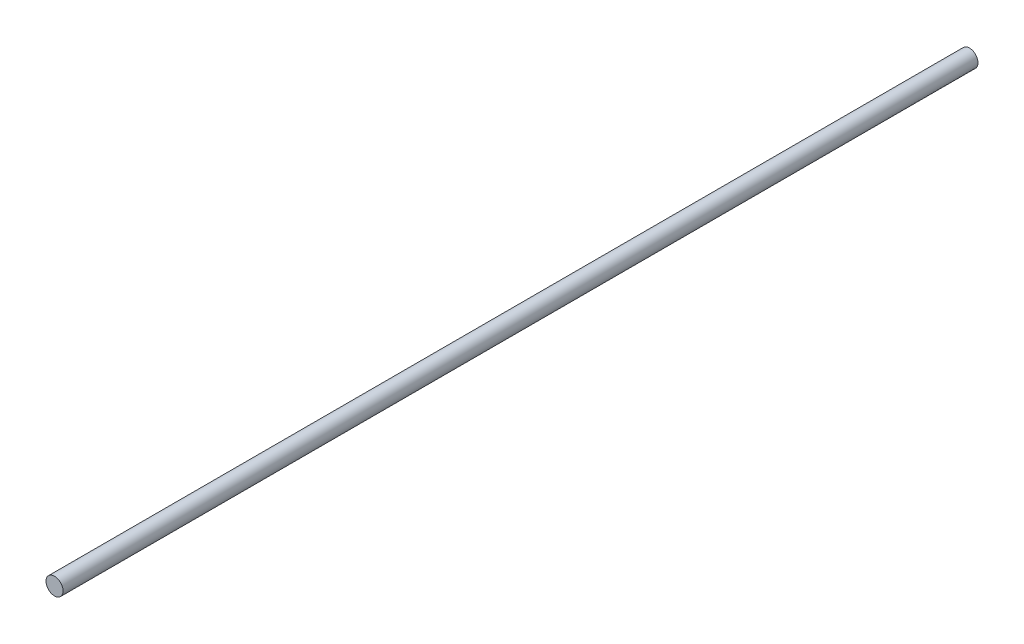
ISO-10303-21;
HEADER;
FILE_DESCRIPTION(('STEP AP214'),'2;1');
FILE_NAME('part.step','',(''),(''),'','','');
FILE_SCHEMA(('AUTOMOTIVE_DESIGN { 1 0 10303 214 1 1 1 1 }'));
ENDSEC;
DATA;
#1=APPLICATION_CONTEXT('core data for automotive mechanical design processes');
#2=APPLICATION_PROTOCOL_DEFINITION('international standard','automotive_design',2000,#1);
#3=PRODUCT_CONTEXT('',#1,'mechanical');
#4=PRODUCT('Part','Part','',(#3));
#5=PRODUCT_RELATED_PRODUCT_CATEGORY('part','',(#4));
#6=PRODUCT_DEFINITION_FORMATION('','',#4);
#7=PRODUCT_DEFINITION_CONTEXT('part definition',#1,'design');
#8=PRODUCT_DEFINITION('design','',#6,#7);
#9=PRODUCT_DEFINITION_SHAPE('','',#8);
#10=(LENGTH_UNIT() NAMED_UNIT(*) SI_UNIT(.MILLI.,.METRE.));
#11=(NAMED_UNIT(*) PLANE_ANGLE_UNIT() SI_UNIT($,.RADIAN.));
#12=(NAMED_UNIT(*) SI_UNIT($,.STERADIAN.) SOLID_ANGLE_UNIT());
#13=UNCERTAINTY_MEASURE_WITH_UNIT(LENGTH_MEASURE(1.E-05),#10,'distance_accuracy_value','');
#14=(GEOMETRIC_REPRESENTATION_CONTEXT(3) GLOBAL_UNCERTAINTY_ASSIGNED_CONTEXT((#13)) GLOBAL_UNIT_ASSIGNED_CONTEXT((#10,
#11,#12)) REPRESENTATION_CONTEXT('',''));
#15=CARTESIAN_POINT('',(0.,0.,0.));
#16=DIRECTION('',(0.,0.,1.));
#17=DIRECTION('',(1.,0.,0.));
#18=AXIS2_PLACEMENT_3D('',#15,#16,#17);
#19=CARTESIAN_POINT('',(0.,0.,-510.));
#20=DIRECTION('',(0.,0.,1.));
#21=DIRECTION('',(1.,0.,0.));
#22=AXIS2_PLACEMENT_3D('',#19,#20,#21);
#23=CYLINDRICAL_SURFACE('',#22,4.7625);
#24=CARTESIAN_POINT('',(0.,0.,-510.));
#25=DIRECTION('',(0.,0.,1.));
#26=DIRECTION('',(1.,0.,0.));
#27=AXIS2_PLACEMENT_3D('',#24,#25,#26);
#28=CIRCLE('',#27,4.7625);
#29=CARTESIAN_POINT('',(4.7625,0.,-510.));
#30=VERTEX_POINT('',#29);
#31=EDGE_CURVE('E10',#30,#30,#28,.T.);
#32=ORIENTED_EDGE('',*,*,#31,.T.);
#33=EDGE_LOOP('',(#32));
#34=FACE_BOUND('',#33,.T.);
#35=CARTESIAN_POINT('',(0.,0.,0.));
#36=DIRECTION('',(0.,0.,1.));
#37=DIRECTION('',(1.,0.,0.));
#38=AXIS2_PLACEMENT_3D('',#35,#36,#37);
#39=CIRCLE('',#38,4.7625);
#40=CARTESIAN_POINT('',(4.7625,0.,0.));
#41=VERTEX_POINT('',#40);
#42=EDGE_CURVE('E36',#41,#41,#39,.T.);
#43=ORIENTED_EDGE('',*,*,#42,.F.);
#44=EDGE_LOOP('',(#43));
#45=FACE_BOUND('',#44,.T.);
#46=ADVANCED_FACE('F33',(#34,#45),#23,.T.);
#47=CARTESIAN_POINT('',(0.,0.,-510.));
#48=DIRECTION('',(0.,0.,1.));
#49=DIRECTION('',(1.,0.,0.));
#50=AXIS2_PLACEMENT_3D('',#47,#48,#49);
#51=PLANE('',#50);
#52=ORIENTED_EDGE('',*,*,#31,.F.);
#53=EDGE_LOOP('',(#52));
#54=FACE_BOUND('',#53,.T.);
#55=ADVANCED_FACE('F48',(#54),#51,.F.);
#56=CARTESIAN_POINT('',(0.,0.,0.));
#57=DIRECTION('',(0.,0.,1.));
#58=DIRECTION('',(1.,0.,0.));
#59=AXIS2_PLACEMENT_3D('',#56,#57,#58);
#60=PLANE('',#59);
#61=ORIENTED_EDGE('',*,*,#42,.T.);
#62=EDGE_LOOP('',(#61));
#63=FACE_BOUND('',#62,.T.);
#64=ADVANCED_FACE('F45',(#63),#60,.T.);
#65=CLOSED_SHELL('',(#46,#55,#64));
#66=MANIFOLD_SOLID_BREP('B2',#65);
#67=ADVANCED_BREP_SHAPE_REPRESENTATION('',(#18,#66),#14);
#68=SHAPE_DEFINITION_REPRESENTATION(#9,#67);
ENDSEC;
END-ISO-10303-21;
